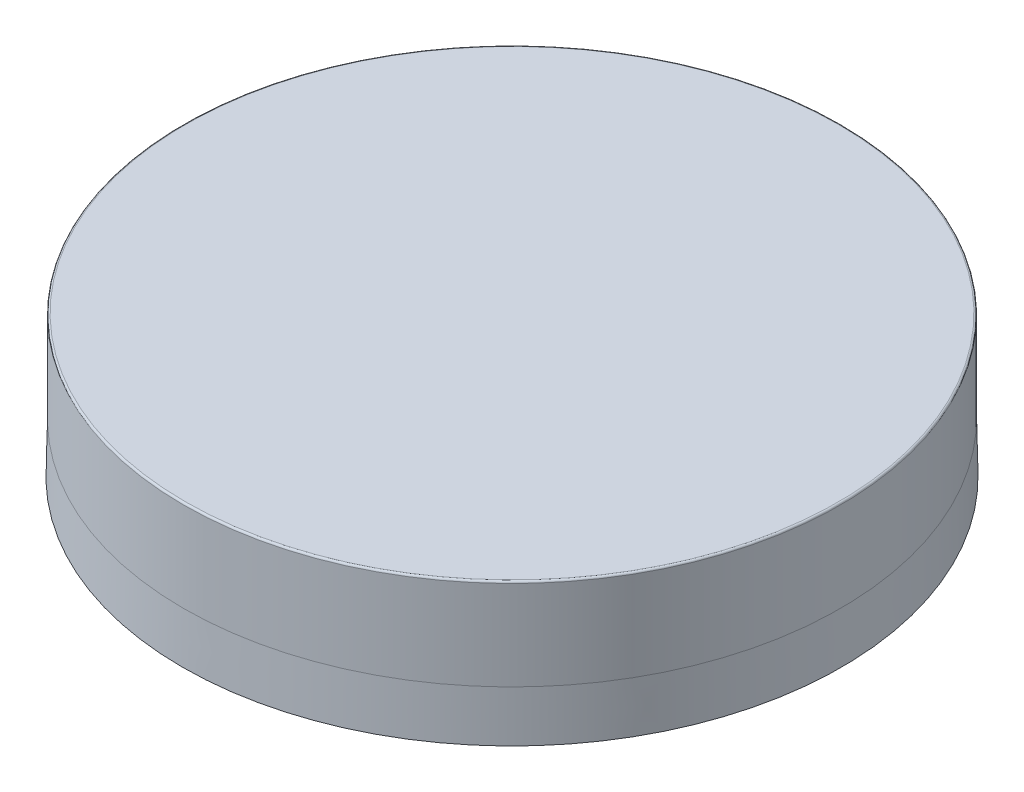
ISO-10303-21;
HEADER;
FILE_DESCRIPTION(('STEP AP214'),'2;1');
FILE_NAME('part.step','',(''),(''),'','','');
FILE_SCHEMA(('AUTOMOTIVE_DESIGN { 1 0 10303 214 1 1 1 1 }'));
ENDSEC;
DATA;
#1=APPLICATION_CONTEXT('core data for automotive mechanical design processes');
#2=APPLICATION_PROTOCOL_DEFINITION('international standard','automotive_design',2000,#1);
#3=PRODUCT_CONTEXT('',#1,'mechanical');
#4=PRODUCT('Part','Part','',(#3));
#5=PRODUCT_RELATED_PRODUCT_CATEGORY('part','',(#4));
#6=PRODUCT_DEFINITION_FORMATION('','',#4);
#7=PRODUCT_DEFINITION_CONTEXT('part definition',#1,'design');
#8=PRODUCT_DEFINITION('design','',#6,#7);
#9=PRODUCT_DEFINITION_SHAPE('','',#8);
#10=(LENGTH_UNIT() NAMED_UNIT(*) SI_UNIT(.MILLI.,.METRE.));
#11=(NAMED_UNIT(*) PLANE_ANGLE_UNIT() SI_UNIT($,.RADIAN.));
#12=(NAMED_UNIT(*) SI_UNIT($,.STERADIAN.) SOLID_ANGLE_UNIT());
#13=UNCERTAINTY_MEASURE_WITH_UNIT(LENGTH_MEASURE(1.E-05),#10,'distance_accuracy_value','');
#14=(GEOMETRIC_REPRESENTATION_CONTEXT(3) GLOBAL_UNCERTAINTY_ASSIGNED_CONTEXT((#13)) GLOBAL_UNIT_ASSIGNED_CONTEXT((#10,
#11,#12)) REPRESENTATION_CONTEXT('',''));
#15=CARTESIAN_POINT('',(0.,0.,0.));
#16=DIRECTION('',(0.,0.,1.));
#17=DIRECTION('',(1.,0.,0.));
#18=AXIS2_PLACEMENT_3D('',#15,#16,#17);
#19=CARTESIAN_POINT('',(0.,19.304,0.));
#20=DIRECTION('',(0.,-1.,0.));
#21=DIRECTION('',(0.,0.,-1.));
#22=AXIS2_PLACEMENT_3D('',#19,#20,#21);
#23=PLANE('',#22);
#24=CARTESIAN_POINT('',(0.,19.304,0.));
#25=DIRECTION('',(0.,-1.,0.));
#26=DIRECTION('',(0.,0.,-1.));
#27=AXIS2_PLACEMENT_3D('',#24,#25,#26);
#28=CIRCLE('',#27,44.45);
#29=CARTESIAN_POINT('',(0.,19.304,-44.45));
#30=VERTEX_POINT('',#29);
#31=EDGE_CURVE('E10',#30,#30,#28,.T.);
#32=ORIENTED_EDGE('',*,*,#31,.F.);
#33=EDGE_LOOP('',(#32));
#34=FACE_BOUND('',#33,.T.);
#35=ADVANCED_FACE('F37',(#34),#23,.F.);
#36=CARTESIAN_POINT('',(0.,19.05,0.));
#37=DIRECTION('',(0.,-1.,0.));
#38=DIRECTION('',(0.,0.,-1.));
#39=AXIS2_PLACEMENT_3D('',#36,#37,#38);
#40=TOROIDAL_SURFACE('',#39,44.45,0.253999999999997);
#41=CARTESIAN_POINT('',(0.,19.05,0.));
#42=DIRECTION('',(0.,-1.,0.));
#43=DIRECTION('',(0.,0.,-1.));
#44=AXIS2_PLACEMENT_3D('',#41,#42,#43);
#45=CIRCLE('',#44,44.704);
#46=CARTESIAN_POINT('',(0.,19.05,-44.704));
#47=VERTEX_POINT('',#46);
#48=EDGE_CURVE('E43',#47,#47,#45,.T.);
#49=ORIENTED_EDGE('',*,*,#48,.F.);
#50=EDGE_LOOP('',(#49));
#51=FACE_BOUND('',#50,.T.);
#52=ORIENTED_EDGE('',*,*,#31,.T.);
#53=EDGE_LOOP('',(#52));
#54=FACE_BOUND('',#53,.T.);
#55=ADVANCED_FACE('F175',(#51,#54),#40,.T.);
#56=CARTESIAN_POINT('',(0.,0.,0.));
#57=DIRECTION('',(0.,-1.,0.));
#58=DIRECTION('',(0.,0.,-1.));
#59=AXIS2_PLACEMENT_3D('',#56,#57,#58);
#60=CYLINDRICAL_SURFACE('',#59,44.704);
#61=CARTESIAN_POINT('',(0.,6.858,0.));
#62=DIRECTION('',(0.,-1.,0.));
#63=DIRECTION('',(0.,0.,-1.));
#64=AXIS2_PLACEMENT_3D('',#61,#62,#63);
#65=CIRCLE('',#64,44.704);
#66=CARTESIAN_POINT('',(0.,6.858,-44.704));
#67=VERTEX_POINT('',#66);
#68=EDGE_CURVE('E47',#67,#67,#65,.T.);
#69=ORIENTED_EDGE('',*,*,#68,.F.);
#70=EDGE_LOOP('',(#69));
#71=FACE_BOUND('',#70,.T.);
#72=ORIENTED_EDGE('',*,*,#48,.T.);
#73=EDGE_LOOP('',(#72));
#74=FACE_BOUND('',#73,.T.);
#75=ADVANCED_FACE('F170',(#71,#74),#60,.T.);
#76=CARTESIAN_POINT('',(0.,6.858,0.));
#77=DIRECTION('',(0.,-1.,0.));
#78=DIRECTION('',(0.,0.,-1.));
#79=AXIS2_PLACEMENT_3D('',#76,#77,#78);
#80=CONICAL_SURFACE('',#79,44.704,0.0208303200362162);
#81=CARTESIAN_POINT('',(0.,0.,0.));
#82=DIRECTION('',(0.,-1.,0.));
#83=DIRECTION('',(0.,0.,-1.));
#84=AXIS2_PLACEMENT_3D('',#81,#82,#83);
#85=CIRCLE('',#84,44.846875);
#86=CARTESIAN_POINT('',(0.,0.,-44.846875));
#87=VERTEX_POINT('',#86);
#88=EDGE_CURVE('E51',#87,#87,#85,.T.);
#89=ORIENTED_EDGE('',*,*,#88,.F.);
#90=EDGE_LOOP('',(#89));
#91=FACE_BOUND('',#90,.T.);
#92=ORIENTED_EDGE('',*,*,#68,.T.);
#93=EDGE_LOOP('',(#92));
#94=FACE_BOUND('',#93,.T.);
#95=ADVANCED_FACE('F164',(#91,#94),#80,.T.);
#96=CARTESIAN_POINT('',(-44.846875,0.,0.));
#97=DIRECTION('',(0.,1.,0.));
#98=DIRECTION('',(0.,0.,1.));
#99=AXIS2_PLACEMENT_3D('',#96,#97,#98);
#100=PLANE('',#99);
#101=CARTESIAN_POINT('',(0.,0.,0.));
#102=DIRECTION('',(0.,-1.,0.));
#103=DIRECTION('',(0.,0.,-1.));
#104=AXIS2_PLACEMENT_3D('',#101,#102,#103);
#105=CIRCLE('',#104,42.06875);
#106=CARTESIAN_POINT('',(0.,0.,-42.06875));
#107=VERTEX_POINT('',#106);
#108=EDGE_CURVE('E56',#107,#107,#105,.T.);
#109=ORIENTED_EDGE('',*,*,#108,.F.);
#110=EDGE_LOOP('',(#109));
#111=FACE_BOUND('',#110,.T.);
#112=ORIENTED_EDGE('',*,*,#88,.T.);
#113=EDGE_LOOP('',(#112));
#114=FACE_BOUND('',#113,.T.);
#115=ADVANCED_FACE('F158',(#111,#114),#100,.F.);
#116=CARTESIAN_POINT('',(0.,0.79375,0.));
#117=DIRECTION('',(0.,-1.,0.));
#118=DIRECTION('',(0.,0.,-1.));
#119=AXIS2_PLACEMENT_3D('',#116,#117,#118);
#120=TOROIDAL_SURFACE('',#119,42.06875,0.793749999999998);
#121=CARTESIAN_POINT('',(0.,1.12745751623613,0.));
#122=DIRECTION('',(0.,-1.,0.));
#123=DIRECTION('',(0.,0.,-1.));
#124=AXIS2_PLACEMENT_3D('',#121,#122,#123);
#125=CIRCLE('',#124,41.3485567230892);
#126=CARTESIAN_POINT('',(0.,1.12745751623613,-41.3485567230892));
#127=VERTEX_POINT('',#126);
#128=EDGE_CURVE('E59',#127,#127,#125,.T.);
#129=ORIENTED_EDGE('',*,*,#128,.F.);
#130=EDGE_LOOP('',(#129));
#131=FACE_BOUND('',#130,.T.);
#132=ORIENTED_EDGE('',*,*,#108,.T.);
#133=EDGE_LOOP('',(#132));
#134=FACE_BOUND('',#133,.T.);
#135=ADVANCED_FACE('F152',(#131,#134),#120,.T.);
#136=CARTESIAN_POINT('',(0.,1.12745751623613,0.));
#137=DIRECTION('',(0.,1.,0.));
#138=DIRECTION('',(0.,0.,1.));
#139=AXIS2_PLACEMENT_3D('',#136,#137,#138);
#140=CONICAL_SURFACE('',#139,41.3485567230892,0.433906974875434);
#141=CARTESIAN_POINT('',(0.,4.92125302888607,0.));
#142=DIRECTION('',(0.,-1.,0.));
#143=DIRECTION('',(0.,0.,-1.));
#144=AXIS2_PLACEMENT_3D('',#141,#142,#143);
#145=CIRCLE('',#144,43.1064432769108);
#146=CARTESIAN_POINT('',(0.,4.92125302888607,-43.1064432769108));
#147=VERTEX_POINT('',#146);
#148=EDGE_CURVE('E62',#147,#147,#145,.T.);
#149=ORIENTED_EDGE('',*,*,#148,.F.);
#150=EDGE_LOOP('',(#149));
#151=FACE_BOUND('',#150,.T.);
#152=ORIENTED_EDGE('',*,*,#128,.T.);
#153=EDGE_LOOP('',(#152));
#154=FACE_BOUND('',#153,.T.);
#155=ADVANCED_FACE('F146',(#151,#154),#140,.F.);
#156=CARTESIAN_POINT('',(0.,5.2549605451222,0.));
#157=DIRECTION('',(0.,-1.,0.));
#158=DIRECTION('',(0.,0.,-1.));
#159=AXIS2_PLACEMENT_3D('',#156,#157,#158);
#160=TOROIDAL_SURFACE('',#159,42.38625,0.793750000000007);
#161=CARTESIAN_POINT('',(0.,5.2549605451222,0.));
#162=DIRECTION('',(0.,-1.,0.));
#163=DIRECTION('',(0.,0.,-1.));
#164=AXIS2_PLACEMENT_3D('',#161,#162,#163);
#165=CIRCLE('',#164,43.18);
#166=CARTESIAN_POINT('',(0.,5.2549605451222,-43.18));
#167=VERTEX_POINT('',#166);
#168=EDGE_CURVE('E65',#167,#167,#165,.T.);
#169=ORIENTED_EDGE('',*,*,#168,.F.);
#170=EDGE_LOOP('',(#169));
#171=FACE_BOUND('',#170,.T.);
#172=ORIENTED_EDGE('',*,*,#148,.T.);
#173=EDGE_LOOP('',(#172));
#174=FACE_BOUND('',#173,.T.);
#175=ADVANCED_FACE('F140',(#171,#174),#160,.F.);
#176=CARTESIAN_POINT('',(0.,0.,0.));
#177=DIRECTION('',(0.,-1.,0.));
#178=DIRECTION('',(0.,0.,-1.));
#179=AXIS2_PLACEMENT_3D('',#176,#177,#178);
#180=CYLINDRICAL_SURFACE('',#179,43.18);
#181=CARTESIAN_POINT('',(0.,8.09624999999999,0.));
#182=DIRECTION('',(0.,-1.,0.));
#183=DIRECTION('',(0.,0.,-1.));
#184=AXIS2_PLACEMENT_3D('',#181,#182,#183);
#185=CIRCLE('',#184,43.18);
#186=CARTESIAN_POINT('',(0.,8.09624999999999,-43.18));
#187=VERTEX_POINT('',#186);
#188=EDGE_CURVE('E68',#187,#187,#185,.T.);
#189=ORIENTED_EDGE('',*,*,#188,.F.);
#190=EDGE_LOOP('',(#189));
#191=FACE_BOUND('',#190,.T.);
#192=ORIENTED_EDGE('',*,*,#168,.T.);
#193=EDGE_LOOP('',(#192));
#194=FACE_BOUND('',#193,.T.);
#195=ADVANCED_FACE('F134',(#191,#194),#180,.F.);
#196=CARTESIAN_POINT('',(0.,8.09624999999999,0.));
#197=DIRECTION('',(0.,-1.,0.));
#198=DIRECTION('',(0.,0.,-1.));
#199=AXIS2_PLACEMENT_3D('',#196,#197,#198);
#200=TOROIDAL_SURFACE('',#199,42.38625,0.793750000000001);
#201=CARTESIAN_POINT('',(0.,8.88999999999999,0.));
#202=DIRECTION('',(0.,-1.,0.));
#203=DIRECTION('',(0.,0.,-1.));
#204=AXIS2_PLACEMENT_3D('',#201,#202,#203);
#205=CIRCLE('',#204,42.38625);
#206=CARTESIAN_POINT('',(0.,8.88999999999999,-42.38625));
#207=VERTEX_POINT('',#206);
#208=EDGE_CURVE('E71',#207,#207,#205,.T.);
#209=ORIENTED_EDGE('',*,*,#208,.F.);
#210=EDGE_LOOP('',(#209));
#211=FACE_BOUND('',#210,.T.);
#212=ORIENTED_EDGE('',*,*,#188,.T.);
#213=EDGE_LOOP('',(#212));
#214=FACE_BOUND('',#213,.T.);
#215=ADVANCED_FACE('F128',(#211,#214),#200,.F.);
#216=CARTESIAN_POINT('',(-42.38625,8.89,0.));
#217=DIRECTION('',(0.,1.,0.));
#218=DIRECTION('',(0.,0.,1.));
#219=AXIS2_PLACEMENT_3D('',#216,#217,#218);
#220=PLANE('',#219);
#221=CARTESIAN_POINT('',(0.,8.89,0.));
#222=DIRECTION('',(0.,-1.,0.));
#223=DIRECTION('',(0.,0.,-1.));
#224=AXIS2_PLACEMENT_3D('',#221,#222,#223);
#225=CIRCLE('',#224,41.068625);
#226=CARTESIAN_POINT('',(0.,8.89,-41.068625));
#227=VERTEX_POINT('',#226);
#228=EDGE_CURVE('E74',#227,#227,#225,.T.);
#229=ORIENTED_EDGE('',*,*,#228,.F.);
#230=EDGE_LOOP('',(#229));
#231=FACE_BOUND('',#230,.T.);
#232=ORIENTED_EDGE('',*,*,#208,.T.);
#233=EDGE_LOOP('',(#232));
#234=FACE_BOUND('',#233,.T.);
#235=ADVANCED_FACE('F122',(#231,#234),#220,.F.);
#236=CARTESIAN_POINT('',(0.,9.68375,0.));
#237=DIRECTION('',(0.,-1.,0.));
#238=DIRECTION('',(0.,0.,-1.));
#239=AXIS2_PLACEMENT_3D('',#236,#237,#238);
#240=TOROIDAL_SURFACE('',#239,41.068625,0.793749999999997);
#241=CARTESIAN_POINT('',(0.,10.1479146278413,0.));
#242=DIRECTION('',(0.,-1.,0.));
#243=DIRECTION('',(0.,0.,-1.));
#244=AXIS2_PLACEMENT_3D('',#241,#242,#243);
#245=CIRCLE('',#244,40.4247381615253);
#246=CARTESIAN_POINT('',(0.,10.1479146278413,-40.4247381615253));
#247=VERTEX_POINT('',#246);
#248=EDGE_CURVE('E77',#247,#247,#245,.T.);
#249=ORIENTED_EDGE('',*,*,#248,.F.);
#250=EDGE_LOOP('',(#249));
#251=FACE_BOUND('',#250,.T.);
#252=ORIENTED_EDGE('',*,*,#228,.T.);
#253=EDGE_LOOP('',(#252));
#254=FACE_BOUND('',#253,.T.);
#255=ADVANCED_FACE('F116',(#251,#254),#240,.T.);
#256=CARTESIAN_POINT('',(0.,10.1479146278413,0.));
#257=DIRECTION('',(0.,1.,0.));
#258=DIRECTION('',(0.,0.,1.));
#259=AXIS2_PLACEMENT_3D('',#256,#257,#258);
#260=CONICAL_SURFACE('',#259,40.4247381615253,0.624601840977576);
#261=CARTESIAN_POINT('',(0.,13.7621105756655,0.));
#262=DIRECTION('',(0.,-1.,0.));
#263=DIRECTION('',(0.,0.,-1.));
#264=AXIS2_PLACEMENT_3D('',#261,#262,#263);
#265=CIRCLE('',#264,43.0301368384747);
#266=CARTESIAN_POINT('',(0.,13.7621105756655,-43.0301368384747));
#267=VERTEX_POINT('',#266);
#268=EDGE_CURVE('E80',#267,#267,#265,.T.);
#269=ORIENTED_EDGE('',*,*,#268,.F.);
#270=EDGE_LOOP('',(#269));
#271=FACE_BOUND('',#270,.T.);
#272=ORIENTED_EDGE('',*,*,#248,.T.);
#273=EDGE_LOOP('',(#272));
#274=FACE_BOUND('',#273,.T.);
#275=ADVANCED_FACE('F110',(#271,#274),#260,.F.);
#276=CARTESIAN_POINT('',(0.,14.2262752035068,0.));
#277=DIRECTION('',(0.,-1.,0.));
#278=DIRECTION('',(0.,0.,-1.));
#279=AXIS2_PLACEMENT_3D('',#276,#277,#278);
#280=TOROIDAL_SURFACE('',#279,42.38625,0.793749999999995);
#281=CARTESIAN_POINT('',(0.,14.2262752035068,0.));
#282=DIRECTION('',(0.,-1.,0.));
#283=DIRECTION('',(0.,0.,-1.));
#284=AXIS2_PLACEMENT_3D('',#281,#282,#283);
#285=CIRCLE('',#284,43.18);
#286=CARTESIAN_POINT('',(0.,14.2262752035068,-43.18));
#287=VERTEX_POINT('',#286);
#288=EDGE_CURVE('E83',#287,#287,#285,.T.);
#289=ORIENTED_EDGE('',*,*,#288,.F.);
#290=EDGE_LOOP('',(#289));
#291=FACE_BOUND('',#290,.T.);
#292=ORIENTED_EDGE('',*,*,#268,.T.);
#293=EDGE_LOOP('',(#292));
#294=FACE_BOUND('',#293,.T.);
#295=ADVANCED_FACE('F104',(#291,#294),#280,.F.);
#296=CARTESIAN_POINT('',(0.,0.,0.));
#297=DIRECTION('',(0.,-1.,0.));
#298=DIRECTION('',(0.,0.,-1.));
#299=AXIS2_PLACEMENT_3D('',#296,#297,#298);
#300=CYLINDRICAL_SURFACE('',#299,43.18);
#301=CARTESIAN_POINT('',(0.,17.526,0.));
#302=DIRECTION('',(0.,-1.,0.));
#303=DIRECTION('',(0.,0.,-1.));
#304=AXIS2_PLACEMENT_3D('',#301,#302,#303);
#305=CIRCLE('',#304,43.18);
#306=CARTESIAN_POINT('',(0.,17.526,-43.18));
#307=VERTEX_POINT('',#306);
#308=EDGE_CURVE('E86',#307,#307,#305,.T.);
#309=ORIENTED_EDGE('',*,*,#308,.F.);
#310=EDGE_LOOP('',(#309));
#311=FACE_BOUND('',#310,.T.);
#312=ORIENTED_EDGE('',*,*,#288,.T.);
#313=EDGE_LOOP('',(#312));
#314=FACE_BOUND('',#313,.T.);
#315=ADVANCED_FACE('F98',(#311,#314),#300,.F.);
#316=CARTESIAN_POINT('',(0.,17.526,0.));
#317=DIRECTION('',(0.,-1.,0.));
#318=DIRECTION('',(0.,0.,-1.));
#319=AXIS2_PLACEMENT_3D('',#316,#317,#318);
#320=TOROIDAL_SURFACE('',#319,42.926,0.254000000000003);
#321=CARTESIAN_POINT('',(0.,17.78,0.));
#322=DIRECTION('',(0.,-1.,0.));
#323=DIRECTION('',(0.,0.,-1.));
#324=AXIS2_PLACEMENT_3D('',#321,#322,#323);
#325=CIRCLE('',#324,42.926);
#326=CARTESIAN_POINT('',(0.,17.78,-42.926));
#327=VERTEX_POINT('',#326);
#328=EDGE_CURVE('E89',#327,#327,#325,.T.);
#329=ORIENTED_EDGE('',*,*,#328,.F.);
#330=EDGE_LOOP('',(#329));
#331=FACE_BOUND('',#330,.T.);
#332=ORIENTED_EDGE('',*,*,#308,.T.);
#333=EDGE_LOOP('',(#332));
#334=FACE_BOUND('',#333,.T.);
#335=ADVANCED_FACE('F95',(#331,#334),#320,.F.);
#336=CARTESIAN_POINT('',(-42.926,17.78,0.));
#337=DIRECTION('',(0.,1.,0.));
#338=DIRECTION('',(0.,0.,1.));
#339=AXIS2_PLACEMENT_3D('',#336,#337,#338);
#340=PLANE('',#339);
#341=ORIENTED_EDGE('',*,*,#328,.T.);
#342=EDGE_LOOP('',(#341));
#343=FACE_BOUND('',#342,.T.);
#344=ADVANCED_FACE('F93',(#343),#340,.F.);
#345=CLOSED_SHELL('',(#35,#55,#75,#95,#115,#135,#155,#175,#195,#215,#235,#255,#275,#295,#315,
#335,#344));
#346=MANIFOLD_SOLID_BREP('B2',#345);
#347=ADVANCED_BREP_SHAPE_REPRESENTATION('',(#18,#346),#14);
#348=SHAPE_DEFINITION_REPRESENTATION(#9,#347);
ENDSEC;
END-ISO-10303-21;
